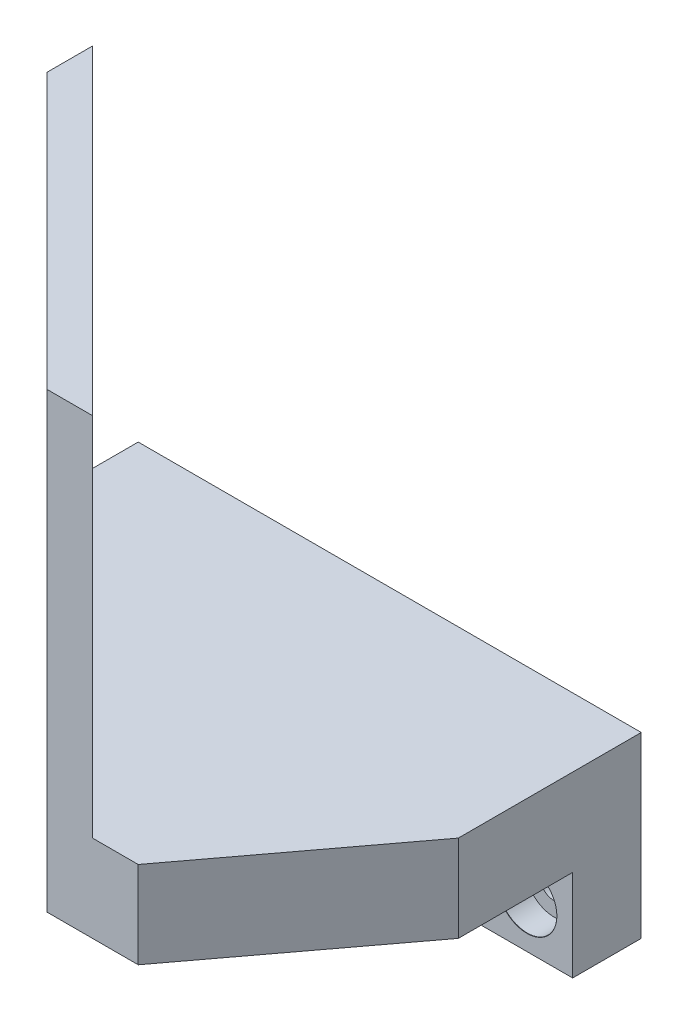
ISO-10303-21;
HEADER;
FILE_DESCRIPTION(('STEP AP214'),'2;1');
FILE_NAME('part.step','',(''),(''),'','','');
FILE_SCHEMA(('AUTOMOTIVE_DESIGN { 1 0 10303 214 1 1 1 1 }'));
ENDSEC;
DATA;
#1=APPLICATION_CONTEXT('core data for automotive mechanical design processes');
#2=APPLICATION_PROTOCOL_DEFINITION('international standard','automotive_design',2000,#1);
#3=PRODUCT_CONTEXT('',#1,'mechanical');
#4=PRODUCT('Part','Part','',(#3));
#5=PRODUCT_RELATED_PRODUCT_CATEGORY('part','',(#4));
#6=PRODUCT_DEFINITION_FORMATION('','',#4);
#7=PRODUCT_DEFINITION_CONTEXT('part definition',#1,'design');
#8=PRODUCT_DEFINITION('design','',#6,#7);
#9=PRODUCT_DEFINITION_SHAPE('','',#8);
#10=(LENGTH_UNIT() NAMED_UNIT(*) SI_UNIT(.MILLI.,.METRE.));
#11=(NAMED_UNIT(*) PLANE_ANGLE_UNIT() SI_UNIT($,.RADIAN.));
#12=(NAMED_UNIT(*) SI_UNIT($,.STERADIAN.) SOLID_ANGLE_UNIT());
#13=UNCERTAINTY_MEASURE_WITH_UNIT(LENGTH_MEASURE(1.E-05),#10,'distance_accuracy_value','');
#14=(GEOMETRIC_REPRESENTATION_CONTEXT(3) GLOBAL_UNCERTAINTY_ASSIGNED_CONTEXT((#13)) GLOBAL_UNIT_ASSIGNED_CONTEXT((#10,
#11,#12)) REPRESENTATION_CONTEXT('',''));
#15=CARTESIAN_POINT('',(0.,0.,0.));
#16=DIRECTION('',(0.,0.,1.));
#17=DIRECTION('',(1.,0.,0.));
#18=AXIS2_PLACEMENT_3D('',#15,#16,#17);
#19=CARTESIAN_POINT('',(-15.,49.5,10.));
#20=DIRECTION('',(0.707106781186548,0.,-0.707106781186548));
#21=DIRECTION('',(-0.707106781186548,0.,-0.707106781186548));
#22=AXIS2_PLACEMENT_3D('',#19,#20,#21);
#23=PLANE('',#22);
#24=CARTESIAN_POINT('',(10.6066017177982,29.5,35.6066017177982));
#25=DIRECTION('',(-0.707106781186548,0.,0.707106781186547));
#26=DIRECTION('',(0.707106781186547,0.,0.707106781186548));
#27=AXIS2_PLACEMENT_3D('',#24,#25,#26);
#28=CIRCLE('',#27,2.575);
#29=CARTESIAN_POINT('',(12.4274016793536,29.5,37.4274016793536));
#30=VERTEX_POINT('',#29);
#31=EDGE_CURVE('E254',#30,#30,#28,.T.);
#32=ORIENTED_EDGE('',*,*,#31,.F.);
#33=EDGE_LOOP('',(#32));
#34=FACE_BOUND('',#33,.T.);
#35=DIRECTION('',(0.,-1.,0.));
#36=VECTOR('',#35,1.);
#37=CARTESIAN_POINT('',(-15.,49.5,10.));
#38=LINE('',#37,#36);
#39=CARTESIAN_POINT('',(-15.,49.5,10.));
#40=VERTEX_POINT('',#39);
#41=CARTESIAN_POINT('',(-15.,0.,9.99999999999999));
#42=VERTEX_POINT('',#41);
#43=EDGE_CURVE('E222',#40,#42,#38,.T.);
#44=ORIENTED_EDGE('',*,*,#43,.T.);
#45=DIRECTION('',(-0.707106781186547,0.,-0.707106781186548));
#46=VECTOR('',#45,1.);
#47=CARTESIAN_POINT('',(0.,0.,25.));
#48=LINE('',#47,#46);
#49=CARTESIAN_POINT('',(15.,0.,40.));
#50=VERTEX_POINT('',#49);
#51=EDGE_CURVE('E238',#50,#42,#48,.T.);
#52=ORIENTED_EDGE('',*,*,#51,.F.);
#53=DIRECTION('',(0.,-1.,0.));
#54=VECTOR('',#53,1.);
#55=CARTESIAN_POINT('',(15.,49.5,40.));
#56=LINE('',#55,#54);
#57=CARTESIAN_POINT('',(15.,49.5,40.));
#58=VERTEX_POINT('',#57);
#59=EDGE_CURVE('E225',#58,#50,#56,.T.);
#60=ORIENTED_EDGE('',*,*,#59,.F.);
#61=DIRECTION('',(0.707106781186547,0.,0.707106781186547));
#62=VECTOR('',#61,1.);
#63=CARTESIAN_POINT('',(-15.,49.5,10.));
#64=LINE('',#63,#62);
#65=EDGE_CURVE('E242',#40,#58,#64,.T.);
#66=ORIENTED_EDGE('',*,*,#65,.F.);
#67=EDGE_LOOP('',(#44,#52,#60,#66));
#68=FACE_BOUND('',#67,.T.);
#69=CARTESIAN_POINT('',(-10.6066017177982,29.5,14.3933982822018));
#70=DIRECTION('',(-0.707106781186548,0.,0.707106781186547));
#71=DIRECTION('',(0.707106781186547,0.,0.707106781186548));
#72=AXIS2_PLACEMENT_3D('',#69,#70,#71);
#73=CIRCLE('',#72,2.575);
#74=CARTESIAN_POINT('',(-8.78580175624286,29.5,16.2141982437572));
#75=VERTEX_POINT('',#74);
#76=EDGE_CURVE('E263',#75,#75,#73,.T.);
#77=ORIENTED_EDGE('',*,*,#76,.F.);
#78=EDGE_LOOP('',(#77));
#79=FACE_BOUND('',#78,.T.);
#80=ADVANCED_FACE('F40',(#34,#68,#79),#23,.F.);
#81=CARTESIAN_POINT('',(-15.,9.5,40.));
#82=DIRECTION('',(0.,-1.,0.));
#83=DIRECTION('',(0.,0.,-1.));
#84=AXIS2_PLACEMENT_3D('',#81,#82,#83);
#85=PLANE('',#84);
#86=DIRECTION('',(-1.,0.,0.));
#87=VECTOR('',#86,1.);
#88=CARTESIAN_POINT('',(-15.,9.5,40.));
#89=LINE('',#88,#87);
#90=CARTESIAN_POINT('',(25.,9.5,40.));
#91=VERTEX_POINT('',#90);
#92=CARTESIAN_POINT('',(20.,9.5,40.));
#93=VERTEX_POINT('',#92);
#94=EDGE_CURVE('E61',#91,#93,#89,.T.);
#95=ORIENTED_EDGE('',*,*,#94,.F.);
#96=DIRECTION('',(-0.6,0.,0.8));
#97=VECTOR('',#96,1.);
#98=CARTESIAN_POINT('',(40.,9.5,20.));
#99=LINE('',#98,#97);
#100=CARTESIAN_POINT('',(40.,9.5,20.));
#101=VERTEX_POINT('',#100);
#102=EDGE_CURVE('E54',#101,#91,#99,.T.);
#103=ORIENTED_EDGE('',*,*,#102,.F.);
#104=DIRECTION('',(0.,0.,-1.));
#105=VECTOR('',#104,1.);
#106=CARTESIAN_POINT('',(40.,9.5,40.));
#107=LINE('',#106,#105);
#108=CARTESIAN_POINT('',(40.,9.5,0.));
#109=VERTEX_POINT('',#108);
#110=EDGE_CURVE('E132',#101,#109,#107,.T.);
#111=ORIENTED_EDGE('',*,*,#110,.T.);
#112=DIRECTION('',(-1.,0.,0.));
#113=VECTOR('',#112,1.);
#114=CARTESIAN_POINT('',(-15.,9.5,0.));
#115=LINE('',#114,#113);
#116=CARTESIAN_POINT('',(-15.,9.5,0.));
#117=VERTEX_POINT('',#116);
#118=EDGE_CURVE('E214',#109,#117,#115,.T.);
#119=ORIENTED_EDGE('',*,*,#118,.T.);
#120=DIRECTION('',(0.,0.,-1.));
#121=VECTOR('',#120,1.);
#122=CARTESIAN_POINT('',(-15.,9.5,40.));
#123=LINE('',#122,#121);
#124=CARTESIAN_POINT('',(-15.,9.5,5.));
#125=VERTEX_POINT('',#124);
#126=EDGE_CURVE('E141',#125,#117,#123,.T.);
#127=ORIENTED_EDGE('',*,*,#126,.F.);
#128=DIRECTION('',(-0.707106781186548,0.,-0.707106781186548));
#129=VECTOR('',#128,1.);
#130=CARTESIAN_POINT('',(-15.,9.5,5.));
#131=LINE('',#130,#129);
#132=EDGE_CURVE('E234',#93,#125,#131,.T.);
#133=ORIENTED_EDGE('',*,*,#132,.F.);
#134=EDGE_LOOP('',(#95,#103,#111,#119,#127,#133));
#135=FACE_BOUND('',#134,.T.);
#136=ADVANCED_FACE('F130',(#135),#85,.F.);
#137=CARTESIAN_POINT('',(0.,0.,7.5));
#138=DIRECTION('',(1.,0.,0.));
#139=DIRECTION('',(0.,1.,0.));
#140=AXIS2_PLACEMENT_3D('',#137,#138,#139);
#141=PLANE('',#140);
#142=DIRECTION('',(0.,-1.,0.));
#143=VECTOR('',#142,1.);
#144=CARTESIAN_POINT('',(0.,0.,0.));
#145=LINE('',#144,#143);
#146=CARTESIAN_POINT('',(0.,0.,0.));
#147=VERTEX_POINT('',#146);
#148=CARTESIAN_POINT('',(0.,-10.,0.));
#149=VERTEX_POINT('',#148);
#150=EDGE_CURVE('E179',#147,#149,#145,.T.);
#151=ORIENTED_EDGE('',*,*,#150,.T.);
#152=DIRECTION('',(0.,0.,-1.));
#153=VECTOR('',#152,1.);
#154=CARTESIAN_POINT('',(0.,-10.,7.5));
#155=LINE('',#154,#153);
#156=CARTESIAN_POINT('',(0.,-10.,7.5));
#157=VERTEX_POINT('',#156);
#158=EDGE_CURVE('E48',#157,#149,#155,.T.);
#159=ORIENTED_EDGE('',*,*,#158,.F.);
#160=DIRECTION('',(0.,-1.,0.));
#161=VECTOR('',#160,1.);
#162=CARTESIAN_POINT('',(0.,0.,7.5));
#163=LINE('',#162,#161);
#164=CARTESIAN_POINT('',(0.,0.,7.5));
#165=VERTEX_POINT('',#164);
#166=EDGE_CURVE('E180',#165,#157,#163,.T.);
#167=ORIENTED_EDGE('',*,*,#166,.F.);
#168=DIRECTION('',(0.,0.,-1.));
#169=VECTOR('',#168,1.);
#170=CARTESIAN_POINT('',(0.,0.,7.5));
#171=LINE('',#170,#169);
#172=EDGE_CURVE('E191',#165,#147,#171,.T.);
#173=ORIENTED_EDGE('',*,*,#172,.T.);
#174=EDGE_LOOP('',(#151,#159,#167,#173));
#175=FACE_BOUND('',#174,.T.);
#176=ADVANCED_FACE('F42',(#175),#141,.F.);
#177=CARTESIAN_POINT('',(0.,-10.,7.5));
#178=DIRECTION('',(0.,1.,0.));
#179=DIRECTION('',(0.,0.,1.));
#180=AXIS2_PLACEMENT_3D('',#177,#178,#179);
#181=PLANE('',#180);
#182=DIRECTION('',(1.,0.,0.));
#183=VECTOR('',#182,1.);
#184=CARTESIAN_POINT('',(0.,-10.,0.));
#185=LINE('',#184,#183);
#186=CARTESIAN_POINT('',(40.,-10.,0.));
#187=VERTEX_POINT('',#186);
#188=EDGE_CURVE('E194',#149,#187,#185,.T.);
#189=ORIENTED_EDGE('',*,*,#188,.T.);
#190=DIRECTION('',(0.,0.,-1.));
#191=VECTOR('',#190,1.);
#192=CARTESIAN_POINT('',(40.,-10.,7.5));
#193=LINE('',#192,#191);
#194=CARTESIAN_POINT('',(40.,-10.,7.5));
#195=VERTEX_POINT('',#194);
#196=EDGE_CURVE('E199',#195,#187,#193,.T.);
#197=ORIENTED_EDGE('',*,*,#196,.F.);
#198=DIRECTION('',(1.,0.,0.));
#199=VECTOR('',#198,1.);
#200=CARTESIAN_POINT('',(0.,-10.,7.5));
#201=LINE('',#200,#199);
#202=EDGE_CURVE('E183',#157,#195,#201,.T.);
#203=ORIENTED_EDGE('',*,*,#202,.F.);
#204=ORIENTED_EDGE('',*,*,#158,.T.);
#205=EDGE_LOOP('',(#189,#197,#203,#204));
#206=FACE_BOUND('',#205,.T.);
#207=ADVANCED_FACE('F203',(#206),#181,.F.);
#208=CARTESIAN_POINT('',(40.,0.,7.5));
#209=DIRECTION('',(-1.,0.,0.));
#210=DIRECTION('',(0.,0.,1.));
#211=AXIS2_PLACEMENT_3D('',#208,#209,#210);
#212=PLANE('',#211);
#213=ORIENTED_EDGE('',*,*,#110,.F.);
#214=DIRECTION('',(0.,1.,0.));
#215=VECTOR('',#214,1.);
#216=CARTESIAN_POINT('',(40.,-10.,20.));
#217=LINE('',#216,#215);
#218=CARTESIAN_POINT('',(40.,0.,20.));
#219=VERTEX_POINT('',#218);
#220=EDGE_CURVE('E121',#219,#101,#217,.T.);
#221=ORIENTED_EDGE('',*,*,#220,.F.);
#222=DIRECTION('',(0.,0.,-1.));
#223=VECTOR('',#222,1.);
#224=CARTESIAN_POINT('',(40.,0.,40.));
#225=LINE('',#224,#223);
#226=CARTESIAN_POINT('',(40.,0.,7.5));
#227=VERTEX_POINT('',#226);
#228=EDGE_CURVE('E140',#219,#227,#225,.T.);
#229=ORIENTED_EDGE('',*,*,#228,.T.);
#230=DIRECTION('',(0.,1.,0.));
#231=VECTOR('',#230,1.);
#232=CARTESIAN_POINT('',(40.,0.,7.5));
#233=LINE('',#232,#231);
#234=EDGE_CURVE('E185',#195,#227,#233,.T.);
#235=ORIENTED_EDGE('',*,*,#234,.F.);
#236=ORIENTED_EDGE('',*,*,#196,.T.);
#237=DIRECTION('',(0.,1.,0.));
#238=VECTOR('',#237,1.);
#239=CARTESIAN_POINT('',(40.,0.,0.));
#240=LINE('',#239,#238);
#241=EDGE_CURVE('E138',#187,#109,#240,.T.);
#242=ORIENTED_EDGE('',*,*,#241,.T.);
#243=EDGE_LOOP('',(#213,#221,#229,#235,#236,#242));
#244=FACE_BOUND('',#243,.T.);
#245=ADVANCED_FACE('F135',(#244),#212,.F.);
#246=CARTESIAN_POINT('',(0.,0.,7.5));
#247=DIRECTION('',(0.,0.,1.));
#248=DIRECTION('',(1.,0.,0.));
#249=AXIS2_PLACEMENT_3D('',#246,#247,#248);
#250=PLANE('',#249);
#251=CARTESIAN_POINT('',(5.,-5.,7.5));
#252=DIRECTION('',(0.,0.,1.));
#253=DIRECTION('',(1.,0.,0.));
#254=AXIS2_PLACEMENT_3D('',#251,#252,#253);
#255=CIRCLE('',#254,3.275);
#256=CARTESIAN_POINT('',(8.275,-5.,7.5));
#257=VERTEX_POINT('',#256);
#258=EDGE_CURVE('E149',#257,#257,#255,.T.);
#259=ORIENTED_EDGE('',*,*,#258,.F.);
#260=EDGE_LOOP('',(#259));
#261=FACE_BOUND('',#260,.T.);
#262=CARTESIAN_POINT('',(35.,-5.,7.5));
#263=DIRECTION('',(0.,0.,1.));
#264=DIRECTION('',(1.,0.,0.));
#265=AXIS2_PLACEMENT_3D('',#262,#263,#264);
#266=CIRCLE('',#265,3.275);
#267=CARTESIAN_POINT('',(38.275,-5.,7.5));
#268=VERTEX_POINT('',#267);
#269=EDGE_CURVE('E164',#268,#268,#266,.T.);
#270=ORIENTED_EDGE('',*,*,#269,.F.);
#271=EDGE_LOOP('',(#270));
#272=FACE_BOUND('',#271,.T.);
#273=ORIENTED_EDGE('',*,*,#166,.T.);
#274=ORIENTED_EDGE('',*,*,#202,.T.);
#275=ORIENTED_EDGE('',*,*,#234,.T.);
#276=DIRECTION('',(-1.,0.,0.));
#277=VECTOR('',#276,1.);
#278=CARTESIAN_POINT('',(0.,0.,7.5));
#279=LINE('',#278,#277);
#280=EDGE_CURVE('E188',#227,#165,#279,.T.);
#281=ORIENTED_EDGE('',*,*,#280,.T.);
#282=EDGE_LOOP('',(#273,#274,#275,#281));
#283=FACE_BOUND('',#282,.T.);
#284=ADVANCED_FACE('F347',(#261,#272,#283),#250,.T.);
#285=CARTESIAN_POINT('',(0.,0.,0.));
#286=DIRECTION('',(0.,0.,1.));
#287=DIRECTION('',(1.,0.,0.));
#288=AXIS2_PLACEMENT_3D('',#285,#286,#287);
#289=PLANE('',#288);
#290=CARTESIAN_POINT('',(5.,-5.,0.));
#291=DIRECTION('',(0.,0.,1.));
#292=DIRECTION('',(1.,0.,0.));
#293=AXIS2_PLACEMENT_3D('',#290,#291,#292);
#294=CIRCLE('',#293,1.7);
#295=CARTESIAN_POINT('',(6.7,-5.,0.));
#296=VERTEX_POINT('',#295);
#297=EDGE_CURVE('E161',#296,#296,#294,.T.);
#298=ORIENTED_EDGE('',*,*,#297,.T.);
#299=EDGE_LOOP('',(#298));
#300=FACE_BOUND('',#299,.T.);
#301=CARTESIAN_POINT('',(35.,-5.,0.));
#302=DIRECTION('',(0.,0.,1.));
#303=DIRECTION('',(1.,0.,0.));
#304=AXIS2_PLACEMENT_3D('',#301,#302,#303);
#305=CIRCLE('',#304,1.7);
#306=CARTESIAN_POINT('',(36.7,-5.,0.));
#307=VERTEX_POINT('',#306);
#308=EDGE_CURVE('E176',#307,#307,#305,.T.);
#309=ORIENTED_EDGE('',*,*,#308,.T.);
#310=EDGE_LOOP('',(#309));
#311=FACE_BOUND('',#310,.T.);
#312=ORIENTED_EDGE('',*,*,#150,.F.);
#313=DIRECTION('',(1.,0.,0.));
#314=VECTOR('',#313,1.);
#315=CARTESIAN_POINT('',(-15.,0.,0.));
#316=LINE('',#315,#314);
#317=CARTESIAN_POINT('',(-15.,0.,0.));
#318=VERTEX_POINT('',#317);
#319=EDGE_CURVE('E212',#318,#147,#316,.T.);
#320=ORIENTED_EDGE('',*,*,#319,.F.);
#321=DIRECTION('',(0.,-1.,0.));
#322=VECTOR('',#321,1.);
#323=CARTESIAN_POINT('',(-15.,9.5,0.));
#324=LINE('',#323,#322);
#325=EDGE_CURVE('E215',#117,#318,#324,.T.);
#326=ORIENTED_EDGE('',*,*,#325,.F.);
#327=ORIENTED_EDGE('',*,*,#118,.F.);
#328=ORIENTED_EDGE('',*,*,#241,.F.);
#329=ORIENTED_EDGE('',*,*,#188,.F.);
#330=EDGE_LOOP('',(#312,#320,#326,#327,#328,#329));
#331=FACE_BOUND('',#330,.T.);
#332=ADVANCED_FACE('F210',(#300,#311,#331),#289,.F.);
#333=CARTESIAN_POINT('',(35.,-5.,7.5));
#334=DIRECTION('',(0.,0.,1.));
#335=DIRECTION('',(1.,0.,0.));
#336=AXIS2_PLACEMENT_3D('',#333,#334,#335);
#337=CYLINDRICAL_SURFACE('',#336,1.7);
#338=ORIENTED_EDGE('',*,*,#308,.F.);
#339=EDGE_LOOP('',(#338));
#340=FACE_BOUND('',#339,.T.);
#341=CARTESIAN_POINT('',(35.,-5.,4.5));
#342=DIRECTION('',(0.,0.,1.));
#343=DIRECTION('',(1.,0.,0.));
#344=AXIS2_PLACEMENT_3D('',#341,#342,#343);
#345=CIRCLE('',#344,1.7);
#346=CARTESIAN_POINT('',(36.7,-5.,4.5));
#347=VERTEX_POINT('',#346);
#348=EDGE_CURVE('E173',#347,#347,#345,.T.);
#349=ORIENTED_EDGE('',*,*,#348,.T.);
#350=EDGE_LOOP('',(#349));
#351=FACE_BOUND('',#350,.T.);
#352=ADVANCED_FACE('F342',(#340,#351),#337,.F.);
#353=CARTESIAN_POINT('',(38.25,-5.,4.5));
#354=DIRECTION('',(0.,0.,-1.));
#355=DIRECTION('',(-1.,0.,0.));
#356=AXIS2_PLACEMENT_3D('',#353,#354,#355);
#357=PLANE('',#356);
#358=ORIENTED_EDGE('',*,*,#348,.F.);
#359=EDGE_LOOP('',(#358));
#360=FACE_BOUND('',#359,.T.);
#361=CARTESIAN_POINT('',(35.,-5.,4.5));
#362=DIRECTION('',(0.,0.,1.));
#363=DIRECTION('',(1.,0.,0.));
#364=AXIS2_PLACEMENT_3D('',#361,#362,#363);
#365=CIRCLE('',#364,3.25);
#366=CARTESIAN_POINT('',(38.25,-5.,4.5));
#367=VERTEX_POINT('',#366);
#368=EDGE_CURVE('E170',#367,#367,#365,.T.);
#369=ORIENTED_EDGE('',*,*,#368,.T.);
#370=EDGE_LOOP('',(#369));
#371=FACE_BOUND('',#370,.T.);
#372=ADVANCED_FACE('F338',(#360,#371),#357,.F.);
#373=CARTESIAN_POINT('',(35.,-5.,7.5));
#374=DIRECTION('',(0.,0.,1.));
#375=DIRECTION('',(1.,0.,0.));
#376=AXIS2_PLACEMENT_3D('',#373,#374,#375);
#377=CYLINDRICAL_SURFACE('',#376,3.25);
#378=ORIENTED_EDGE('',*,*,#368,.F.);
#379=EDGE_LOOP('',(#378));
#380=FACE_BOUND('',#379,.T.);
#381=CARTESIAN_POINT('',(35.,-5.,7.475));
#382=DIRECTION('',(0.,0.,1.));
#383=DIRECTION('',(1.,0.,0.));
#384=AXIS2_PLACEMENT_3D('',#381,#382,#383);
#385=CIRCLE('',#384,3.25);
#386=CARTESIAN_POINT('',(38.25,-5.,7.475));
#387=VERTEX_POINT('',#386);
#388=EDGE_CURVE('E167',#387,#387,#385,.T.);
#389=ORIENTED_EDGE('',*,*,#388,.T.);
#390=EDGE_LOOP('',(#389));
#391=FACE_BOUND('',#390,.T.);
#392=ADVANCED_FACE('F334',(#380,#391),#377,.F.);
#393=CARTESIAN_POINT('',(35.,-5.,7.5));
#394=DIRECTION('',(0.,0.,1.));
#395=DIRECTION('',(1.,0.,0.));
#396=AXIS2_PLACEMENT_3D('',#393,#394,#395);
#397=CONICAL_SURFACE('',#396,3.275,0.785398163397379);
#398=ORIENTED_EDGE('',*,*,#388,.F.);
#399=EDGE_LOOP('',(#398));
#400=FACE_BOUND('',#399,.T.);
#401=ORIENTED_EDGE('',*,*,#269,.T.);
#402=EDGE_LOOP('',(#401));
#403=FACE_BOUND('',#402,.T.);
#404=ADVANCED_FACE('F330',(#400,#403),#397,.F.);
#405=CARTESIAN_POINT('',(5.,-5.,7.5));
#406=DIRECTION('',(0.,0.,1.));
#407=DIRECTION('',(1.,0.,0.));
#408=AXIS2_PLACEMENT_3D('',#405,#406,#407);
#409=CYLINDRICAL_SURFACE('',#408,1.7);
#410=ORIENTED_EDGE('',*,*,#297,.F.);
#411=EDGE_LOOP('',(#410));
#412=FACE_BOUND('',#411,.T.);
#413=CARTESIAN_POINT('',(5.,-5.,4.5));
#414=DIRECTION('',(0.,0.,1.));
#415=DIRECTION('',(1.,0.,0.));
#416=AXIS2_PLACEMENT_3D('',#413,#414,#415);
#417=CIRCLE('',#416,1.7);
#418=CARTESIAN_POINT('',(6.7,-5.,4.5));
#419=VERTEX_POINT('',#418);
#420=EDGE_CURVE('E158',#419,#419,#417,.T.);
#421=ORIENTED_EDGE('',*,*,#420,.T.);
#422=EDGE_LOOP('',(#421));
#423=FACE_BOUND('',#422,.T.);
#424=ADVANCED_FACE('F326',(#412,#423),#409,.F.);
#425=CARTESIAN_POINT('',(8.25,-5.,4.5));
#426=DIRECTION('',(0.,0.,-1.));
#427=DIRECTION('',(-1.,0.,0.));
#428=AXIS2_PLACEMENT_3D('',#425,#426,#427);
#429=PLANE('',#428);
#430=ORIENTED_EDGE('',*,*,#420,.F.);
#431=EDGE_LOOP('',(#430));
#432=FACE_BOUND('',#431,.T.);
#433=CARTESIAN_POINT('',(5.,-5.,4.5));
#434=DIRECTION('',(0.,0.,1.));
#435=DIRECTION('',(1.,0.,0.));
#436=AXIS2_PLACEMENT_3D('',#433,#434,#435);
#437=CIRCLE('',#436,3.25);
#438=CARTESIAN_POINT('',(8.25,-5.,4.5));
#439=VERTEX_POINT('',#438);
#440=EDGE_CURVE('E155',#439,#439,#437,.T.);
#441=ORIENTED_EDGE('',*,*,#440,.T.);
#442=EDGE_LOOP('',(#441));
#443=FACE_BOUND('',#442,.T.);
#444=ADVANCED_FACE('F322',(#432,#443),#429,.F.);
#445=CARTESIAN_POINT('',(5.,-5.,7.5));
#446=DIRECTION('',(0.,0.,1.));
#447=DIRECTION('',(1.,0.,0.));
#448=AXIS2_PLACEMENT_3D('',#445,#446,#447);
#449=CYLINDRICAL_SURFACE('',#448,3.25);
#450=ORIENTED_EDGE('',*,*,#440,.F.);
#451=EDGE_LOOP('',(#450));
#452=FACE_BOUND('',#451,.T.);
#453=CARTESIAN_POINT('',(5.,-5.,7.475));
#454=DIRECTION('',(0.,0.,1.));
#455=DIRECTION('',(1.,0.,0.));
#456=AXIS2_PLACEMENT_3D('',#453,#454,#455);
#457=CIRCLE('',#456,3.25);
#458=CARTESIAN_POINT('',(8.25,-5.,7.475));
#459=VERTEX_POINT('',#458);
#460=EDGE_CURVE('E152',#459,#459,#457,.T.);
#461=ORIENTED_EDGE('',*,*,#460,.T.);
#462=EDGE_LOOP('',(#461));
#463=FACE_BOUND('',#462,.T.);
#464=ADVANCED_FACE('F318',(#452,#463),#449,.F.);
#465=CARTESIAN_POINT('',(5.,-5.,7.5));
#466=DIRECTION('',(0.,0.,1.));
#467=DIRECTION('',(1.,0.,0.));
#468=AXIS2_PLACEMENT_3D('',#465,#466,#467);
#469=CONICAL_SURFACE('',#468,3.275,0.785398163397448);
#470=ORIENTED_EDGE('',*,*,#460,.F.);
#471=EDGE_LOOP('',(#470));
#472=FACE_BOUND('',#471,.T.);
#473=ORIENTED_EDGE('',*,*,#258,.T.);
#474=EDGE_LOOP('',(#473));
#475=FACE_BOUND('',#474,.T.);
#476=ADVANCED_FACE('F315',(#472,#475),#469,.F.);
#477=CARTESIAN_POINT('',(-15.,9.5,40.));
#478=DIRECTION('',(1.,0.,0.));
#479=DIRECTION('',(0.,1.,0.));
#480=AXIS2_PLACEMENT_3D('',#477,#478,#479);
#481=PLANE('',#480);
#482=DIRECTION('',(0.,0.,-1.));
#483=VECTOR('',#482,1.);
#484=CARTESIAN_POINT('',(-15.,0.,40.));
#485=LINE('',#484,#483);
#486=EDGE_CURVE('E143',#42,#318,#485,.T.);
#487=ORIENTED_EDGE('',*,*,#486,.F.);
#488=ORIENTED_EDGE('',*,*,#43,.F.);
#489=DIRECTION('',(0.,0.,1.));
#490=VECTOR('',#489,1.);
#491=CARTESIAN_POINT('',(-15.,49.5,5.));
#492=LINE('',#491,#490);
#493=CARTESIAN_POINT('',(-15.,49.5,5.));
#494=VERTEX_POINT('',#493);
#495=EDGE_CURVE('E237',#494,#40,#492,.T.);
#496=ORIENTED_EDGE('',*,*,#495,.F.);
#497=DIRECTION('',(0.,-1.,0.));
#498=VECTOR('',#497,1.);
#499=CARTESIAN_POINT('',(-15.,49.5,5.));
#500=LINE('',#499,#498);
#501=EDGE_CURVE('E230',#494,#125,#500,.T.);
#502=ORIENTED_EDGE('',*,*,#501,.T.);
#503=ORIENTED_EDGE('',*,*,#126,.T.);
#504=ORIENTED_EDGE('',*,*,#325,.T.);
#505=EDGE_LOOP('',(#487,#488,#496,#502,#503,#504));
#506=FACE_BOUND('',#505,.T.);
#507=ADVANCED_FACE('F279',(#506),#481,.F.);
#508=CARTESIAN_POINT('',(-15.,0.,40.));
#509=DIRECTION('',(0.,1.,0.));
#510=DIRECTION('',(-1.,0.,0.));
#511=AXIS2_PLACEMENT_3D('',#508,#509,#510);
#512=PLANE('',#511);
#513=ORIENTED_EDGE('',*,*,#228,.F.);
#514=DIRECTION('',(-0.6,0.,0.8));
#515=VECTOR('',#514,1.);
#516=CARTESIAN_POINT('',(10.6,0.,59.2));
#517=LINE('',#516,#515);
#518=CARTESIAN_POINT('',(25.,0.,40.));
#519=VERTEX_POINT('',#518);
#520=EDGE_CURVE('E124',#219,#519,#517,.T.);
#521=ORIENTED_EDGE('',*,*,#520,.T.);
#522=DIRECTION('',(1.,0.,0.));
#523=VECTOR('',#522,1.);
#524=CARTESIAN_POINT('',(-15.,0.,40.));
#525=LINE('',#524,#523);
#526=EDGE_CURVE('E216',#50,#519,#525,.T.);
#527=ORIENTED_EDGE('',*,*,#526,.F.);
#528=ORIENTED_EDGE('',*,*,#51,.T.);
#529=ORIENTED_EDGE('',*,*,#486,.T.);
#530=ORIENTED_EDGE('',*,*,#319,.T.);
#531=ORIENTED_EDGE('',*,*,#172,.F.);
#532=ORIENTED_EDGE('',*,*,#280,.F.);
#533=EDGE_LOOP('',(#513,#521,#527,#528,#529,#530,#531,#532));
#534=FACE_BOUND('',#533,.T.);
#535=ADVANCED_FACE('F268',(#534),#512,.F.);
#536=CARTESIAN_POINT('',(0.,0.,40.));
#537=DIRECTION('',(0.,0.,1.));
#538=DIRECTION('',(1.,0.,0.));
#539=AXIS2_PLACEMENT_3D('',#536,#537,#538);
#540=PLANE('',#539);
#541=DIRECTION('',(0.,-1.,0.));
#542=VECTOR('',#541,1.);
#543=CARTESIAN_POINT('',(25.,0.,40.));
#544=LINE('',#543,#542);
#545=EDGE_CURVE('E11',#91,#519,#544,.T.);
#546=ORIENTED_EDGE('',*,*,#545,.F.);
#547=ORIENTED_EDGE('',*,*,#94,.T.);
#548=DIRECTION('',(0.,-1.,0.));
#549=VECTOR('',#548,1.);
#550=CARTESIAN_POINT('',(20.,49.5,40.));
#551=LINE('',#550,#549);
#552=CARTESIAN_POINT('',(20.,49.5,40.));
#553=VERTEX_POINT('',#552);
#554=EDGE_CURVE('E227',#553,#93,#551,.T.);
#555=ORIENTED_EDGE('',*,*,#554,.F.);
#556=DIRECTION('',(1.,0.,0.));
#557=VECTOR('',#556,1.);
#558=CARTESIAN_POINT('',(15.,49.5,40.));
#559=LINE('',#558,#557);
#560=EDGE_CURVE('E240',#58,#553,#559,.T.);
#561=ORIENTED_EDGE('',*,*,#560,.F.);
#562=ORIENTED_EDGE('',*,*,#59,.T.);
#563=ORIENTED_EDGE('',*,*,#526,.T.);
#564=EDGE_LOOP('',(#546,#547,#555,#561,#562,#563));
#565=FACE_BOUND('',#564,.T.);
#566=ADVANCED_FACE('F270',(#565),#540,.T.);
#567=CARTESIAN_POINT('',(-15.,49.5,5.));
#568=DIRECTION('',(-0.707106781186548,0.,0.707106781186548));
#569=DIRECTION('',(0.707106781186548,0.,0.707106781186548));
#570=AXIS2_PLACEMENT_3D('',#567,#568,#569);
#571=PLANE('',#570);
#572=CARTESIAN_POINT('',(-8.10660171779821,29.5,11.8933982822018));
#573=DIRECTION('',(-0.707106781186548,0.,0.707106781186548));
#574=DIRECTION('',(0.707106781186548,0.,0.707106781186548));
#575=AXIS2_PLACEMENT_3D('',#572,#573,#574);
#576=CIRCLE('',#575,2.55);
#577=CARTESIAN_POINT('',(-6.30347942577251,29.5,13.6965205742275));
#578=VERTEX_POINT('',#577);
#579=EDGE_CURVE('E257',#578,#578,#576,.T.);
#580=ORIENTED_EDGE('',*,*,#579,.T.);
#581=EDGE_LOOP('',(#580));
#582=FACE_BOUND('',#581,.T.);
#583=CARTESIAN_POINT('',(13.1066017177982,29.5,33.1066017177982));
#584=DIRECTION('',(-0.707106781186548,0.,0.707106781186548));
#585=DIRECTION('',(0.707106781186548,0.,0.707106781186548));
#586=AXIS2_PLACEMENT_3D('',#583,#584,#585);
#587=CIRCLE('',#586,2.55);
#588=CARTESIAN_POINT('',(14.9097240098239,29.5,34.9097240098239));
#589=VERTEX_POINT('',#588);
#590=EDGE_CURVE('E248',#589,#589,#587,.T.);
#591=ORIENTED_EDGE('',*,*,#590,.T.);
#592=EDGE_LOOP('',(#591));
#593=FACE_BOUND('',#592,.T.);
#594=ORIENTED_EDGE('',*,*,#132,.T.);
#595=ORIENTED_EDGE('',*,*,#501,.F.);
#596=DIRECTION('',(-0.707106781186548,0.,-0.707106781186548));
#597=VECTOR('',#596,1.);
#598=CARTESIAN_POINT('',(-15.,49.5,5.));
#599=LINE('',#598,#597);
#600=EDGE_CURVE('E233',#553,#494,#599,.T.);
#601=ORIENTED_EDGE('',*,*,#600,.F.);
#602=ORIENTED_EDGE('',*,*,#554,.T.);
#603=EDGE_LOOP('',(#594,#595,#601,#602));
#604=FACE_BOUND('',#603,.T.);
#605=ADVANCED_FACE('F283',(#582,#593,#604),#571,.F.);
#606=CARTESIAN_POINT('',(0.,49.5,0.));
#607=DIRECTION('',(0.,1.,0.));
#608=DIRECTION('',(0.,0.,1.));
#609=AXIS2_PLACEMENT_3D('',#606,#607,#608);
#610=PLANE('',#609);
#611=ORIENTED_EDGE('',*,*,#495,.T.);
#612=ORIENTED_EDGE('',*,*,#65,.T.);
#613=ORIENTED_EDGE('',*,*,#560,.T.);
#614=ORIENTED_EDGE('',*,*,#600,.T.);
#615=EDGE_LOOP('',(#611,#612,#613,#614));
#616=FACE_BOUND('',#615,.T.);
#617=ADVANCED_FACE('F286',(#616),#610,.T.);
#618=CARTESIAN_POINT('',(10.6066017177982,29.5,35.6066017177982));
#619=DIRECTION('',(-0.707106781186548,0.,0.707106781186547));
#620=DIRECTION('',(0.707106781186547,0.,0.707106781186548));
#621=AXIS2_PLACEMENT_3D('',#618,#619,#620);
#622=CYLINDRICAL_SURFACE('',#621,2.55);
#623=ORIENTED_EDGE('',*,*,#590,.F.);
#624=EDGE_LOOP('',(#623));
#625=FACE_BOUND('',#624,.T.);
#626=CARTESIAN_POINT('',(10.6242793873279,29.5,35.5889240482686));
#627=DIRECTION('',(-0.707106781186548,0.,0.707106781186547));
#628=DIRECTION('',(0.707106781186547,0.,0.707106781186548));
#629=AXIS2_PLACEMENT_3D('',#626,#627,#628);
#630=CIRCLE('',#629,2.55);
#631=CARTESIAN_POINT('',(12.4274016793536,29.5,37.3920463402943));
#632=VERTEX_POINT('',#631);
#633=EDGE_CURVE('E251',#632,#632,#630,.T.);
#634=ORIENTED_EDGE('',*,*,#633,.T.);
#635=EDGE_LOOP('',(#634));
#636=FACE_BOUND('',#635,.T.);
#637=ADVANCED_FACE('F288',(#625,#636),#622,.F.);
#638=CARTESIAN_POINT('',(10.6066017177982,29.5,35.6066017177982));
#639=DIRECTION('',(-0.707106781186548,0.,0.707106781186547));
#640=DIRECTION('',(0.707106781186547,0.,0.707106781186548));
#641=AXIS2_PLACEMENT_3D('',#638,#639,#640);
#642=CONICAL_SURFACE('',#641,2.575,0.785398163397568);
#643=ORIENTED_EDGE('',*,*,#633,.F.);
#644=EDGE_LOOP('',(#643));
#645=FACE_BOUND('',#644,.T.);
#646=ORIENTED_EDGE('',*,*,#31,.T.);
#647=EDGE_LOOP('',(#646));
#648=FACE_BOUND('',#647,.T.);
#649=ADVANCED_FACE('F295',(#645,#648),#642,.F.);
#650=CARTESIAN_POINT('',(-10.6066017177982,29.5,14.3933982822018));
#651=DIRECTION('',(-0.707106781186548,0.,0.707106781186547));
#652=DIRECTION('',(0.707106781186547,0.,0.707106781186548));
#653=AXIS2_PLACEMENT_3D('',#650,#651,#652);
#654=CYLINDRICAL_SURFACE('',#653,2.55);
#655=ORIENTED_EDGE('',*,*,#579,.F.);
#656=EDGE_LOOP('',(#655));
#657=FACE_BOUND('',#656,.T.);
#658=CARTESIAN_POINT('',(-10.5889240482686,29.5,14.3757206126721));
#659=DIRECTION('',(-0.707106781186548,0.,0.707106781186547));
#660=DIRECTION('',(0.707106781186547,0.,0.707106781186548));
#661=AXIS2_PLACEMENT_3D('',#658,#659,#660);
#662=CIRCLE('',#661,2.55);
#663=CARTESIAN_POINT('',(-8.78580175624286,29.5,16.1788429046978));
#664=VERTEX_POINT('',#663);
#665=EDGE_CURVE('E260',#664,#664,#662,.T.);
#666=ORIENTED_EDGE('',*,*,#665,.T.);
#667=EDGE_LOOP('',(#666));
#668=FACE_BOUND('',#667,.T.);
#669=ADVANCED_FACE('F437',(#657,#668),#654,.F.);
#670=CARTESIAN_POINT('',(-10.6066017177982,29.5,14.3933982822018));
#671=DIRECTION('',(-0.707106781186548,0.,0.707106781186547));
#672=DIRECTION('',(0.707106781186547,0.,0.707106781186548));
#673=AXIS2_PLACEMENT_3D('',#670,#671,#672);
#674=CONICAL_SURFACE('',#673,2.575,0.785398163397405);
#675=ORIENTED_EDGE('',*,*,#665,.F.);
#676=EDGE_LOOP('',(#675));
#677=FACE_BOUND('',#676,.T.);
#678=ORIENTED_EDGE('',*,*,#76,.T.);
#679=EDGE_LOOP('',(#678));
#680=FACE_BOUND('',#679,.T.);
#681=ADVANCED_FACE('F446',(#677,#680),#674,.F.);
#682=CARTESIAN_POINT('',(40.,-10.,20.));
#683=DIRECTION('',(-0.8,0.,-0.6));
#684=DIRECTION('',(-0.6,0.,0.8));
#685=AXIS2_PLACEMENT_3D('',#682,#683,#684);
#686=PLANE('',#685);
#687=ORIENTED_EDGE('',*,*,#220,.T.);
#688=ORIENTED_EDGE('',*,*,#102,.T.);
#689=ORIENTED_EDGE('',*,*,#545,.T.);
#690=ORIENTED_EDGE('',*,*,#520,.F.);
#691=EDGE_LOOP('',(#687,#688,#689,#690));
#692=FACE_BOUND('',#691,.T.);
#693=ADVANCED_FACE('F122',(#692),#686,.F.);
#694=CLOSED_SHELL('',(#80,#136,#176,#207,#245,#284,#332,#352,#372,#392,#404,#424,#444,#464,#476,
#507,#535,#566,#605,#617,#637,#649,#669,#681,#693));
#695=MANIFOLD_SOLID_BREP('B2',#694);
#696=ADVANCED_BREP_SHAPE_REPRESENTATION('',(#18,#695),#14);
#697=SHAPE_DEFINITION_REPRESENTATION(#9,#696);
ENDSEC;
END-ISO-10303-21;
